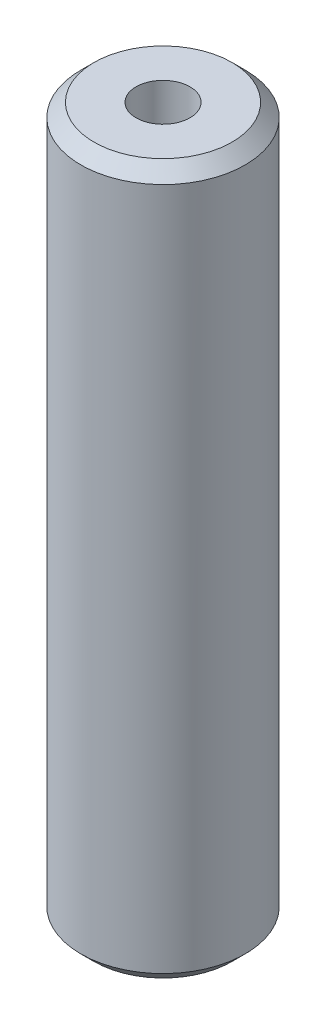
ISO-10303-21;
HEADER;
FILE_DESCRIPTION(('STEP AP214'),'2;1');
FILE_NAME('part.step','',(''),(''),'','','');
FILE_SCHEMA(('AUTOMOTIVE_DESIGN { 1 0 10303 214 1 1 1 1 }'));
ENDSEC;
DATA;
#1=APPLICATION_CONTEXT('core data for automotive mechanical design processes');
#2=APPLICATION_PROTOCOL_DEFINITION('international standard','automotive_design',2000,#1);
#3=PRODUCT_CONTEXT('',#1,'mechanical');
#4=PRODUCT('Part','Part','',(#3));
#5=PRODUCT_RELATED_PRODUCT_CATEGORY('part','',(#4));
#6=PRODUCT_DEFINITION_FORMATION('','',#4);
#7=PRODUCT_DEFINITION_CONTEXT('part definition',#1,'design');
#8=PRODUCT_DEFINITION('design','',#6,#7);
#9=PRODUCT_DEFINITION_SHAPE('','',#8);
#10=(LENGTH_UNIT() NAMED_UNIT(*) SI_UNIT(.MILLI.,.METRE.));
#11=(NAMED_UNIT(*) PLANE_ANGLE_UNIT() SI_UNIT($,.RADIAN.));
#12=(NAMED_UNIT(*) SI_UNIT($,.STERADIAN.) SOLID_ANGLE_UNIT());
#13=UNCERTAINTY_MEASURE_WITH_UNIT(LENGTH_MEASURE(1.E-05),#10,'distance_accuracy_value','');
#14=(GEOMETRIC_REPRESENTATION_CONTEXT(3) GLOBAL_UNCERTAINTY_ASSIGNED_CONTEXT((#13)) GLOBAL_UNIT_ASSIGNED_CONTEXT((#10,
#11,#12)) REPRESENTATION_CONTEXT('',''));
#15=CARTESIAN_POINT('',(0.,0.,0.));
#16=DIRECTION('',(0.,0.,1.));
#17=DIRECTION('',(1.,0.,0.));
#18=AXIS2_PLACEMENT_3D('',#15,#16,#17);
#19=CARTESIAN_POINT('',(0.,86.3352478866057,0.));
#20=DIRECTION('',(0.,-1.,0.));
#21=DIRECTION('',(0.,0.,-1.));
#22=AXIS2_PLACEMENT_3D('',#19,#20,#21);
#23=CYLINDRICAL_SURFACE('',#22,10.);
#24=CARTESIAN_POINT('',(0.,84.7340839255993,0.));
#25=DIRECTION('',(0.,1.,0.));
#26=DIRECTION('',(0.,0.,1.));
#27=AXIS2_PLACEMENT_3D('',#24,#25,#26);
#28=CIRCLE('',#27,10.);
#29=CARTESIAN_POINT('',(0.,84.7340839255993,-10.));
#30=VERTEX_POINT('',#29);
#31=EDGE_CURVE('E50',#30,#30,#28,.F.);
#32=CARTESIAN_POINT('',(0.,1.60116396100636,0.));
#33=DIRECTION('',(0.,1.,0.));
#34=DIRECTION('',(0.,0.,1.));
#35=AXIS2_PLACEMENT_3D('',#32,#33,#34);
#36=CIRCLE('',#35,10.);
#37=CARTESIAN_POINT('',(0.,1.60116396100636,-10.));
#38=VERTEX_POINT('',#37);
#39=EDGE_CURVE('E51',#38,#38,#36,.T.);
#40=CARTESIAN_POINT('',(0.,84.7340839255993,-10.));
#41=CARTESIAN_POINT('',(0.,83.8681160093015,-10.));
#42=CARTESIAN_POINT('',(0.,83.0021480930036,-10.));
#43=CARTESIAN_POINT('',(0.,81.2702122604079,-10.));
#44=CARTESIAN_POINT('',(0.,80.4042443441101,-10.));
#45=CARTESIAN_POINT('',(0.,78.6723085115144,-10.));
#46=CARTESIAN_POINT('',(0.,77.8063405952166,-10.));
#47=CARTESIAN_POINT('',(0.,76.0744047626209,-10.));
#48=CARTESIAN_POINT('',(0.,75.208436846323,-10.));
#49=CARTESIAN_POINT('',(0.,73.4765010137273,-10.));
#50=CARTESIAN_POINT('',(0.,72.6105330974295,-10.));
#51=CARTESIAN_POINT('',(0.,70.8785972648338,-10.));
#52=CARTESIAN_POINT('',(0.,70.012629348536,-10.));
#53=CARTESIAN_POINT('',(0.,68.2806935159403,-10.));
#54=CARTESIAN_POINT('',(0.,67.4147255996424,-10.));
#55=CARTESIAN_POINT('',(0.,65.6827897670468,-10.));
#56=CARTESIAN_POINT('',(0.,64.8168218507489,-10.));
#57=CARTESIAN_POINT('',(0.,63.0848860181532,-10.));
#58=CARTESIAN_POINT('',(0.,62.2189181018554,-10.));
#59=CARTESIAN_POINT('',(0.,60.4869822692597,-10.));
#60=CARTESIAN_POINT('',(0.,59.6210143529619,-10.));
#61=CARTESIAN_POINT('',(0.,57.8890785203662,-10.));
#62=CARTESIAN_POINT('',(0.,57.0231106040683,-10.));
#63=CARTESIAN_POINT('',(0.,55.2911747714726,-10.));
#64=CARTESIAN_POINT('',(0.,54.4252068551748,-10.));
#65=CARTESIAN_POINT('',(0.,52.6932710225791,-10.));
#66=CARTESIAN_POINT('',(0.,51.8273031062813,-10.));
#67=CARTESIAN_POINT('',(0.,50.0953672736856,-10.));
#68=CARTESIAN_POINT('',(0.,49.2293993573877,-10.));
#69=CARTESIAN_POINT('',(0.,47.497463524792,-10.));
#70=CARTESIAN_POINT('',(0.,46.6314956084942,-10.));
#71=CARTESIAN_POINT('',(0.,44.8995597758985,-10.));
#72=CARTESIAN_POINT('',(0.,44.0335918596007,-10.));
#73=CARTESIAN_POINT('',(0.,42.301656027005,-10.));
#74=CARTESIAN_POINT('',(0.,41.4356881107071,-10.));
#75=CARTESIAN_POINT('',(0.,39.7037522781115,-10.));
#76=CARTESIAN_POINT('',(0.,38.8377843618136,-10.));
#77=CARTESIAN_POINT('',(0.,37.1058485292179,-10.));
#78=CARTESIAN_POINT('',(0.,36.2398806129201,-10.));
#79=CARTESIAN_POINT('',(0.,34.5079447803244,-10.));
#80=CARTESIAN_POINT('',(0.,33.6419768640266,-10.));
#81=CARTESIAN_POINT('',(0.,31.9100410314309,-10.));
#82=CARTESIAN_POINT('',(0.,31.044073115133,-10.));
#83=CARTESIAN_POINT('',(0.,29.3121372825373,-10.));
#84=CARTESIAN_POINT('',(0.,28.4461693662395,-10.));
#85=CARTESIAN_POINT('',(0.,26.7142335336438,-10.));
#86=CARTESIAN_POINT('',(0.,25.848265617346,-10.));
#87=CARTESIAN_POINT('',(0.,24.1163297847503,-10.));
#88=CARTESIAN_POINT('',(0.,23.2503618684524,-10.));
#89=CARTESIAN_POINT('',(0.,21.5184260358568,-10.));
#90=CARTESIAN_POINT('',(0.,20.6524581195589,-10.));
#91=CARTESIAN_POINT('',(0.,18.9205222869632,-10.));
#92=CARTESIAN_POINT('',(0.,18.0545543706654,-10.));
#93=CARTESIAN_POINT('',(0.,16.3226185380697,-10.));
#94=CARTESIAN_POINT('',(0.,15.4566506217719,-10.));
#95=CARTESIAN_POINT('',(0.,13.7247147891762,-10.));
#96=CARTESIAN_POINT('',(0.,12.8587468728783,-10.));
#97=CARTESIAN_POINT('',(0.,11.1268110402826,-10.));
#98=CARTESIAN_POINT('',(0.,10.2608431239848,-10.));
#99=CARTESIAN_POINT('',(0.,8.52890729138911,-10.));
#100=CARTESIAN_POINT('',(0.,7.66293937509127,-10.));
#101=CARTESIAN_POINT('',(0.,5.93100354249558,-10.));
#102=CARTESIAN_POINT('',(0.,5.06503562619774,-10.));
#103=CARTESIAN_POINT('',(0.,3.33309979360206,-10.));
#104=CARTESIAN_POINT('',(0.,2.46713187730421,-10.));
#105=CARTESIAN_POINT('',(0.,1.60116396100636,-10.));
#106=B_SPLINE_CURVE_WITH_KNOTS('',3,(#40,#41,#42,#43,#44,#45,#46,#47,#48,#49,#50,#51,#52,#53,
#54,#55,#56,#57,#58,#59,#60,#61,#62,#63,#64,#65,#66,#67,#68,#69,#70,#71,#72,#73,#74,#75,#76,#77,
#78,#79,#80,#81,#82,#83,#84,#85,#86,#87,#88,#89,#90,#91,#92,#93,#94,#95,#96,#97,#98,#99,#100,
#101,#102,#103,#104,#105),.UNSPECIFIED.,.F.,.F.,(4,2,2,2,2,2,2,2,2,2,2,2,2,2,2,2,2,2,2,2,2,2,2,
2,2,2,2,2,2,2,2,2,4),(0.,2.59790374889354,5.19580749778706,7.7937112466806,10.3916149955741,
12.9895187444677,15.5874224933612,18.1853262422547,20.7832299911482,23.3811337400418,
25.9790374889353,28.5769412378288,31.1748449867224,33.7727487356159,36.3706524845094,
38.9685562334029,41.5664599822965,44.16436373119,46.7622674800835,49.3601712289771,
51.9580749778706,54.5559787267641,57.1538824756576,59.7517862245512,62.3496899734447,
64.9475937223382,67.5454974712318,70.1434012201253,72.7413049690188,75.3392087179123,
77.9371124668059,80.5350162156994,83.1329199645929),.UNSPECIFIED.);
#107=EDGE_CURVE('BSEAM39',#30,#38,#106,.T.);
#108=ORIENTED_EDGE('',*,*,#31,.T.);
#109=ORIENTED_EDGE('',*,*,#39,.T.);
#110=ORIENTED_EDGE('',*,*,#107,.T.);
#111=ORIENTED_EDGE('',*,*,#107,.F.);
#112=EDGE_LOOP('',(#108,#110,#109,#111));
#113=FACE_BOUND('',#112,.T.);
#114=ADVANCED_FACE('F39',(#113),#23,.T.);
#115=CARTESIAN_POINT('',(0.,86.3352478866057,0.));
#116=DIRECTION('',(0.,1.,0.));
#117=DIRECTION('',(0.,0.,1.));
#118=AXIS2_PLACEMENT_3D('',#115,#116,#117);
#119=PLANE('',#118);
#120=CARTESIAN_POINT('',(0.,86.3352478866057,0.));
#121=DIRECTION('',(0.,1.,0.));
#122=DIRECTION('',(0.,0.,1.));
#123=AXIS2_PLACEMENT_3D('',#120,#121,#122);
#124=CIRCLE('',#123,8.39883603899366);
#125=CARTESIAN_POINT('',(0.,86.3352478866057,-8.39883603899367));
#126=VERTEX_POINT('',#125);
#127=EDGE_CURVE('E54',#126,#126,#124,.T.);
#128=ORIENTED_EDGE('',*,*,#127,.T.);
#129=EDGE_LOOP('',(#128));
#130=FACE_BOUND('',#129,.T.);
#131=CARTESIAN_POINT('',(0.,86.3352478866057,0.));
#132=DIRECTION('',(0.,1.,0.));
#133=DIRECTION('',(0.,0.,1.));
#134=AXIS2_PLACEMENT_3D('',#131,#132,#133);
#135=CIRCLE('',#134,3.27555445921269);
#136=CARTESIAN_POINT('',(0.,86.3352478866057,3.27555445921269));
#137=VERTEX_POINT('',#136);
#138=EDGE_CURVE('E58',#137,#137,#135,.T.);
#139=ORIENTED_EDGE('',*,*,#138,.F.);
#140=EDGE_LOOP('',(#139));
#141=FACE_BOUND('',#140,.T.);
#142=ADVANCED_FACE('F69',(#130,#141),#119,.T.);
#143=CARTESIAN_POINT('',(0.,0.,0.));
#144=DIRECTION('',(0.,1.,0.));
#145=DIRECTION('',(0.,0.,1.));
#146=AXIS2_PLACEMENT_3D('',#143,#144,#145);
#147=PLANE('',#146);
#148=CARTESIAN_POINT('',(0.,0.,0.));
#149=DIRECTION('',(0.,1.,0.));
#150=DIRECTION('',(0.,0.,1.));
#151=AXIS2_PLACEMENT_3D('',#148,#149,#150);
#152=CIRCLE('',#151,8.39883603899363);
#153=CARTESIAN_POINT('',(0.,0.,8.39883603899363));
#154=VERTEX_POINT('',#153);
#155=EDGE_CURVE('E10',#154,#154,#152,.F.);
#156=ORIENTED_EDGE('',*,*,#155,.T.);
#157=EDGE_LOOP('',(#156));
#158=FACE_BOUND('',#157,.T.);
#159=CARTESIAN_POINT('',(0.,0.,0.));
#160=DIRECTION('',(0.,1.,0.));
#161=DIRECTION('',(0.,0.,1.));
#162=AXIS2_PLACEMENT_3D('',#159,#160,#161);
#163=CIRCLE('',#162,3.27555445921269);
#164=CARTESIAN_POINT('',(0.,0.,3.27555445921269));
#165=VERTEX_POINT('',#164);
#166=EDGE_CURVE('E63',#165,#165,#163,.T.);
#167=ORIENTED_EDGE('',*,*,#166,.T.);
#168=EDGE_LOOP('',(#167));
#169=FACE_BOUND('',#168,.T.);
#170=ADVANCED_FACE('F75',(#158,#169),#147,.F.);
#171=CARTESIAN_POINT('',(0.,86.3352478866057,0.));
#172=DIRECTION('',(0.,-1.,0.));
#173=DIRECTION('',(0.,0.,-1.));
#174=AXIS2_PLACEMENT_3D('',#171,#172,#173);
#175=CYLINDRICAL_SURFACE('',#174,3.27555445921269);
#176=ORIENTED_EDGE('',*,*,#138,.T.);
#177=EDGE_LOOP('',(#176));
#178=FACE_BOUND('',#177,.T.);
#179=ORIENTED_EDGE('',*,*,#166,.F.);
#180=EDGE_LOOP('',(#179));
#181=FACE_BOUND('',#180,.T.);
#182=ADVANCED_FACE('F70',(#178,#181),#175,.F.);
#183=CARTESIAN_POINT('',(0.,86.3352478866057,0.));
#184=DIRECTION('',(0.,-1.,0.));
#185=DIRECTION('',(0.,0.,-1.));
#186=AXIS2_PLACEMENT_3D('',#183,#184,#185);
#187=CONICAL_SURFACE('',#186,8.39883603899366,0.785398163397441);
#188=CARTESIAN_POINT('',(0.,84.7340839255993,-10.));
#189=CARTESIAN_POINT('',(0.,84.7507627168598,-9.98332120873952));
#190=CARTESIAN_POINT('',(0.,84.7674415081203,-9.96664241747904));
#191=CARTESIAN_POINT('',(0.,84.8007990906412,-9.93328483495808));
#192=CARTESIAN_POINT('',(0.,84.8174778819017,-9.91660604369759));
#193=CARTESIAN_POINT('',(0.,84.8508354644227,-9.88324846117663));
#194=CARTESIAN_POINT('',(0.,84.8675142556832,-9.86656966991615));
#195=CARTESIAN_POINT('',(0.,84.9008718382041,-9.83321208739518));
#196=CARTESIAN_POINT('',(0.,84.9175506294646,-9.8165332961347));
#197=CARTESIAN_POINT('',(0.,84.9509082119856,-9.78317571361373));
#198=CARTESIAN_POINT('',(0.,84.9675870032461,-9.76649692235325));
#199=CARTESIAN_POINT('',(0.,85.000944585767,-9.73313933983229));
#200=CARTESIAN_POINT('',(0.,85.0176233770275,-9.7164605485718));
#201=CARTESIAN_POINT('',(0.,85.0509809595485,-9.68310296605083));
#202=CARTESIAN_POINT('',(0.,85.067659750809,-9.66642417479035));
#203=CARTESIAN_POINT('',(0.,85.1010173333299,-9.63306659226939));
#204=CARTESIAN_POINT('',(0.,85.1176961245904,-9.61638780100891));
#205=CARTESIAN_POINT('',(0.,85.1510537071114,-9.58303021848794));
#206=CARTESIAN_POINT('',(0.,85.1677324983718,-9.56635142722746));
#207=CARTESIAN_POINT('',(0.,85.2010900808928,-9.53299384470649));
#208=CARTESIAN_POINT('',(0.,85.2177688721533,-9.51631505344601));
#209=CARTESIAN_POINT('',(0.,85.2511264546743,-9.48295747092505));
#210=CARTESIAN_POINT('',(0.,85.2678052459348,-9.46627867966456));
#211=CARTESIAN_POINT('',(0.,85.3011628284557,-9.4329210971436));
#212=CARTESIAN_POINT('',(0.,85.3178416197162,-9.41624230588311));
#213=CARTESIAN_POINT('',(0.,85.3511992022372,-9.38288472336215));
#214=CARTESIAN_POINT('',(0.,85.3678779934977,-9.36620593210166));
#215=CARTESIAN_POINT('',(0.,85.4012355760186,-9.3328483495807));
#216=CARTESIAN_POINT('',(0.,85.4179143672791,-9.31616955832022));
#217=CARTESIAN_POINT('',(0.,85.4512719498001,-9.28281197579925));
#218=CARTESIAN_POINT('',(0.,85.4679507410605,-9.26613318453877));
#219=CARTESIAN_POINT('',(0.,85.5013083235815,-9.2327756020178));
#220=CARTESIAN_POINT('',(0.,85.517987114842,-9.21609681075732));
#221=CARTESIAN_POINT('',(0.,85.551344697363,-9.18273922823636));
#222=CARTESIAN_POINT('',(0.,85.5680234886235,-9.16606043697588));
#223=CARTESIAN_POINT('',(0.,85.6013810711444,-9.13270285445491));
#224=CARTESIAN_POINT('',(0.,85.6180598624049,-9.11602406319442));
#225=CARTESIAN_POINT('',(0.,85.6514174449259,-9.08266648067346));
#226=CARTESIAN_POINT('',(0.,85.6680962361863,-9.06598768941298));
#227=CARTESIAN_POINT('',(0.,85.7014538187073,-9.03263010689201));
#228=CARTESIAN_POINT('',(0.,85.7181326099678,-9.01595131563153));
#229=CARTESIAN_POINT('',(0.,85.7514901924888,-8.98259373311056));
#230=CARTESIAN_POINT('',(0.,85.7681689837492,-8.96591494185008));
#231=CARTESIAN_POINT('',(0.,85.8015265662702,-8.93255735932911));
#232=CARTESIAN_POINT('',(0.,85.8182053575307,-8.91587856806863));
#233=CARTESIAN_POINT('',(0.,85.8515629400517,-8.88252098554767));
#234=CARTESIAN_POINT('',(0.,85.8682417313122,-8.86584219428719));
#235=CARTESIAN_POINT('',(0.,85.9015993138331,-8.83248461176622));
#236=CARTESIAN_POINT('',(0.,85.9182781050936,-8.81580582050574));
#237=CARTESIAN_POINT('',(0.,85.9516356876145,-8.78244823798477));
#238=CARTESIAN_POINT('',(0.,85.968314478875,-8.76576944672429));
#239=CARTESIAN_POINT('',(0.,86.001672061396,-8.73241186420332));
#240=CARTESIAN_POINT('',(0.,86.0183508526565,-8.71573307294284));
#241=CARTESIAN_POINT('',(0.,86.0517084351775,-8.68237549042188));
#242=CARTESIAN_POINT('',(0.,86.0683872264379,-8.66569669916139));
#243=CARTESIAN_POINT('',(0.,86.1017448089589,-8.63233911664042));
#244=CARTESIAN_POINT('',(0.,86.1184236002194,-8.61566032537994));
#245=CARTESIAN_POINT('',(0.,86.1517811827404,-8.58230274285898));
#246=CARTESIAN_POINT('',(0.,86.1684599740008,-8.5656239515985));
#247=CARTESIAN_POINT('',(0.,86.2018175565218,-8.53226636907753));
#248=CARTESIAN_POINT('',(0.,86.2184963477823,-8.51558757781705));
#249=CARTESIAN_POINT('',(0.,86.2518539303032,-8.48222999529608));
#250=CARTESIAN_POINT('',(0.,86.2685327215637,-8.4655512040356));
#251=CARTESIAN_POINT('',(0.,86.3018903040847,-8.43219362151464));
#252=CARTESIAN_POINT('',(0.,86.3185690953452,-8.41551483025416));
#253=CARTESIAN_POINT('',(0.,86.3352478866057,-8.39883603899367));
#254=B_SPLINE_CURVE_WITH_KNOTS('',3,(#188,#189,#190,#191,#192,#193,#194,#195,#196,#197,#198,
#199,#200,#201,#202,#203,#204,#205,#206,#207,#208,#209,#210,#211,#212,#213,#214,#215,#216,#217,
#218,#219,#220,#221,#222,#223,#224,#225,#226,#227,#228,#229,#230,#231,#232,#233,#234,#235,#236,
#237,#238,#239,#240,#241,#242,#243,#244,#245,#246,#247,#248,#249,#250,#251,#252,#253),
.UNSPECIFIED.,.F.,.F.,(4,2,2,2,2,2,2,2,2,2,2,2,2,2,2,2,2,2,2,2,2,2,2,2,2,2,2,2,2,2,2,2,4),(0.,
0.0707621184136975,0.141524236827394,0.212286355241081,0.283048473654779,0.353810592068476,
0.424572710482164,0.495334828895861,0.566096947309559,0.636859065723245,0.707621184136943,
0.77838330255064,0.849145420964328,0.919907539378025,0.990669657791723,1.06143177620541,
1.13219389461911,1.2029560130328,1.27371813144649,1.34448024986019,1.41524236827389,
1.48600448668757,1.55676660510127,1.62752872351497,1.69829084192866,1.76905296034235,
1.83981507875605,1.91057719716974,1.98133931558344,2.05210143399713,2.12286355241082,
2.19362567082452,2.26438778923821),.UNSPECIFIED.);
#255=EDGE_CURVE('BSEAM81',#30,#126,#254,.T.);
#256=ORIENTED_EDGE('',*,*,#31,.F.);
#257=ORIENTED_EDGE('',*,*,#127,.F.);
#258=ORIENTED_EDGE('',*,*,#255,.T.);
#259=ORIENTED_EDGE('',*,*,#255,.F.);
#260=EDGE_LOOP('',(#256,#258,#257,#259));
#261=FACE_BOUND('',#260,.T.);
#262=ADVANCED_FACE('F81',(#261),#187,.T.);
#263=CARTESIAN_POINT('',(0.,1.60116396100636,0.));
#264=DIRECTION('',(0.,1.,0.));
#265=DIRECTION('',(0.,0.,1.));
#266=AXIS2_PLACEMENT_3D('',#263,#264,#265);
#267=CONICAL_SURFACE('',#266,10.,0.785398163397452);
#268=ORIENTED_EDGE('',*,*,#155,.F.);
#269=EDGE_LOOP('',(#268));
#270=FACE_BOUND('',#269,.T.);
#271=ORIENTED_EDGE('',*,*,#39,.F.);
#272=EDGE_LOOP('',(#271));
#273=FACE_BOUND('',#272,.T.);
#274=ADVANCED_FACE('F45',(#270,#273),#267,.T.);
#275=CLOSED_SHELL('',(#114,#142,#170,#182,#262,#274));
#276=MANIFOLD_SOLID_BREP('B2',#275);
#277=ADVANCED_BREP_SHAPE_REPRESENTATION('',(#18,#276),#14);
#278=SHAPE_DEFINITION_REPRESENTATION(#9,#277);
ENDSEC;
END-ISO-10303-21;
